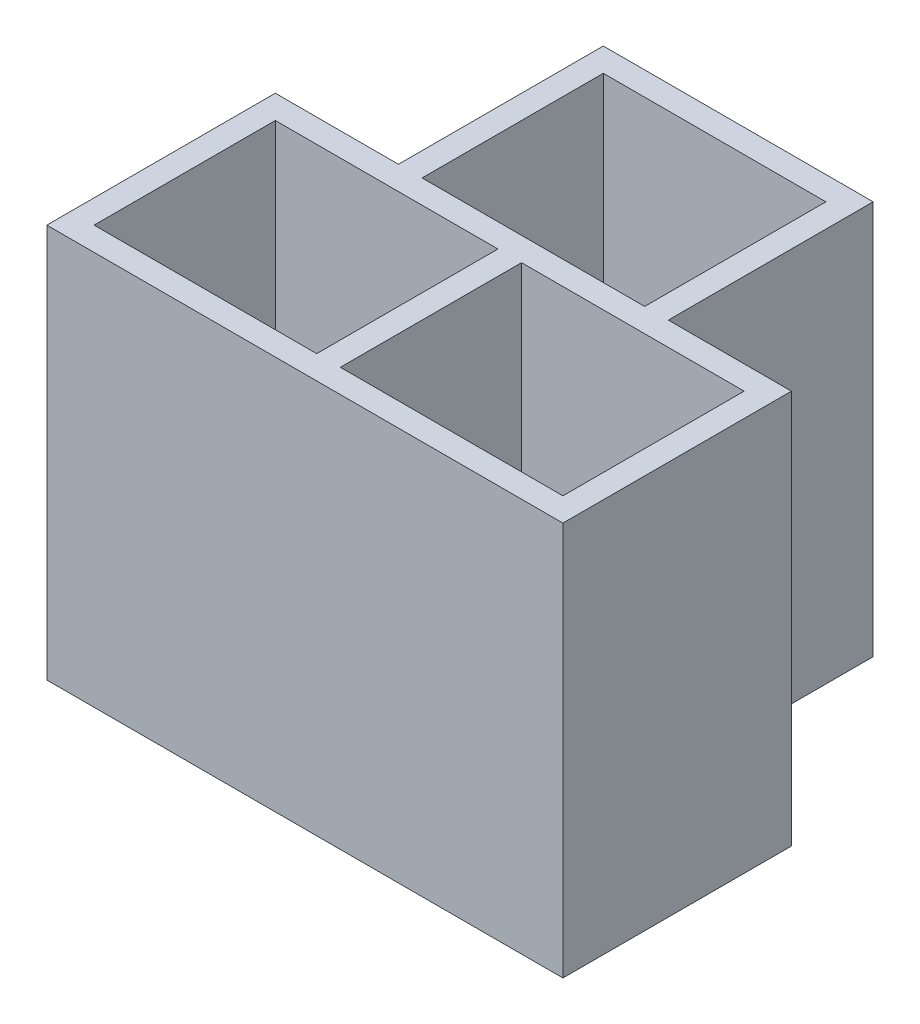
ISO-10303-21;
HEADER;
FILE_DESCRIPTION(('STEP AP214'),'2;1');
FILE_NAME('part.step','',(''),(''),'','','');
FILE_SCHEMA(('AUTOMOTIVE_DESIGN { 1 0 10303 214 1 1 1 1 }'));
ENDSEC;
DATA;
#1=APPLICATION_CONTEXT('core data for automotive mechanical design processes');
#2=APPLICATION_PROTOCOL_DEFINITION('international standard','automotive_design',2000,#1);
#3=PRODUCT_CONTEXT('',#1,'mechanical');
#4=PRODUCT('Part','Part','',(#3));
#5=PRODUCT_RELATED_PRODUCT_CATEGORY('part','',(#4));
#6=PRODUCT_DEFINITION_FORMATION('','',#4);
#7=PRODUCT_DEFINITION_CONTEXT('part definition',#1,'design');
#8=PRODUCT_DEFINITION('design','',#6,#7);
#9=PRODUCT_DEFINITION_SHAPE('','',#8);
#10=(LENGTH_UNIT() NAMED_UNIT(*) SI_UNIT(.MILLI.,.METRE.));
#11=(NAMED_UNIT(*) PLANE_ANGLE_UNIT() SI_UNIT($,.RADIAN.));
#12=(NAMED_UNIT(*) SI_UNIT($,.STERADIAN.) SOLID_ANGLE_UNIT());
#13=UNCERTAINTY_MEASURE_WITH_UNIT(LENGTH_MEASURE(1.E-05),#10,'distance_accuracy_value','');
#14=(GEOMETRIC_REPRESENTATION_CONTEXT(3) GLOBAL_UNCERTAINTY_ASSIGNED_CONTEXT((#13)) GLOBAL_UNIT_ASSIGNED_CONTEXT((#10,
#11,#12)) REPRESENTATION_CONTEXT('',''));
#15=CARTESIAN_POINT('',(0.,0.,0.));
#16=DIRECTION('',(0.,0.,1.));
#17=DIRECTION('',(1.,0.,0.));
#18=AXIS2_PLACEMENT_3D('',#15,#16,#17);
#19=CARTESIAN_POINT('',(-6.55,-5.,-2.9));
#20=DIRECTION('',(0.,0.,-1.));
#21=DIRECTION('',(-1.,0.,0.));
#22=AXIS2_PLACEMENT_3D('',#19,#20,#21);
#23=PLANE('',#22);
#24=DIRECTION('',(-1.,0.,0.));
#25=VECTOR('',#24,1.);
#26=CARTESIAN_POINT('',(-2.825,-1.6,-2.9));
#27=LINE('',#26,#25);
#28=CARTESIAN_POINT('',(2.825,-1.6,-2.9));
#29=VERTEX_POINT('',#28);
#30=CARTESIAN_POINT('',(-2.825,-1.6,-2.9));
#31=VERTEX_POINT('',#30);
#32=EDGE_CURVE('E184',#29,#31,#27,.T.);
#33=ORIENTED_EDGE('',*,*,#32,.T.);
#34=DIRECTION('',(0.,-1.,0.));
#35=VECTOR('',#34,1.);
#36=CARTESIAN_POINT('',(-2.825,13.600145347609,-2.9));
#37=LINE('',#36,#35);
#38=CARTESIAN_POINT('',(-2.825,5.,-2.9));
#39=VERTEX_POINT('',#38);
#40=EDGE_CURVE('E209',#39,#31,#37,.T.);
#41=ORIENTED_EDGE('',*,*,#40,.F.);
#42=DIRECTION('',(-1.,0.,0.));
#43=VECTOR('',#42,1.);
#44=CARTESIAN_POINT('',(-6.55,5.,-2.9));
#45=LINE('',#44,#43);
#46=CARTESIAN_POINT('',(2.825,5.,-2.9));
#47=VERTEX_POINT('',#46);
#48=EDGE_CURVE('E334',#47,#39,#45,.T.);
#49=ORIENTED_EDGE('',*,*,#48,.F.);
#50=DIRECTION('',(0.,-1.,0.));
#51=VECTOR('',#50,1.);
#52=CARTESIAN_POINT('',(2.825,13.600145347609,-2.9));
#53=LINE('',#52,#51);
#54=EDGE_CURVE('E215',#47,#29,#53,.T.);
#55=ORIENTED_EDGE('',*,*,#54,.T.);
#56=EDGE_LOOP('',(#33,#41,#49,#55));
#57=FACE_BOUND('',#56,.T.);
#58=ADVANCED_FACE('F41',(#57),#23,.T.);
#59=DIRECTION('',(-1.,0.,0.));
#60=VECTOR('',#59,1.);
#61=CARTESIAN_POINT('',(-6.55,-5.,-2.9));
#62=LINE('',#61,#60);
#63=CARTESIAN_POINT('',(6.55,-5.,-2.9));
#64=VERTEX_POINT('',#63);
#65=CARTESIAN_POINT('',(3.425,-5.,-2.9));
#66=VERTEX_POINT('',#65);
#67=EDGE_CURVE('E347',#64,#66,#62,.T.);
#68=ORIENTED_EDGE('',*,*,#67,.T.);
#69=DIRECTION('',(0.,-1.,0.));
#70=VECTOR('',#69,1.);
#71=CARTESIAN_POINT('',(3.425,13.600145347609,-2.9));
#72=LINE('',#71,#70);
#73=CARTESIAN_POINT('',(3.425,5.,-2.9));
#74=VERTEX_POINT('',#73);
#75=EDGE_CURVE('E219',#74,#66,#72,.T.);
#76=ORIENTED_EDGE('',*,*,#75,.F.);
#77=CARTESIAN_POINT('',(6.55,5.,-2.9));
#78=VERTEX_POINT('',#77);
#79=EDGE_CURVE('E329',#78,#74,#45,.T.);
#80=ORIENTED_EDGE('',*,*,#79,.F.);
#81=DIRECTION('',(0.,1.,0.));
#82=VECTOR('',#81,1.);
#83=CARTESIAN_POINT('',(6.55,-5.,-2.9));
#84=LINE('',#83,#82);
#85=EDGE_CURVE('E51',#64,#78,#84,.T.);
#86=ORIENTED_EDGE('',*,*,#85,.F.);
#87=EDGE_LOOP('',(#68,#76,#80,#86));
#88=FACE_BOUND('',#87,.T.);
#89=ADVANCED_FACE('F415',(#88),#23,.T.);
#90=CARTESIAN_POINT('',(-6.55,-5.,-2.9));
#91=DIRECTION('',(-1.,0.,0.));
#92=DIRECTION('',(0.,0.,1.));
#93=AXIS2_PLACEMENT_3D('',#90,#91,#92);
#94=PLANE('',#93);
#95=DIRECTION('',(0.,1.,0.));
#96=VECTOR('',#95,1.);
#97=CARTESIAN_POINT('',(-6.55,-5.,2.9));
#98=LINE('',#97,#96);
#99=CARTESIAN_POINT('',(-6.55,-5.,2.9));
#100=VERTEX_POINT('',#99);
#101=CARTESIAN_POINT('',(-6.55,5.,2.9));
#102=VERTEX_POINT('',#101);
#103=EDGE_CURVE('E350',#100,#102,#98,.T.);
#104=ORIENTED_EDGE('',*,*,#103,.T.);
#105=DIRECTION('',(0.,0.,1.));
#106=VECTOR('',#105,1.);
#107=CARTESIAN_POINT('',(-6.55,5.,-2.9));
#108=LINE('',#107,#106);
#109=CARTESIAN_POINT('',(-6.55,5.,-2.9));
#110=VERTEX_POINT('',#109);
#111=EDGE_CURVE('E277',#110,#102,#108,.T.);
#112=ORIENTED_EDGE('',*,*,#111,.F.);
#113=DIRECTION('',(0.,1.,0.));
#114=VECTOR('',#113,1.);
#115=CARTESIAN_POINT('',(-6.55,-5.,-2.9));
#116=LINE('',#115,#114);
#117=CARTESIAN_POINT('',(-6.55,-5.,-2.9));
#118=VERTEX_POINT('',#117);
#119=EDGE_CURVE('E12',#118,#110,#116,.T.);
#120=ORIENTED_EDGE('',*,*,#119,.F.);
#121=DIRECTION('',(0.,0.,1.));
#122=VECTOR('',#121,1.);
#123=CARTESIAN_POINT('',(-6.55,-5.,-2.9));
#124=LINE('',#123,#122);
#125=EDGE_CURVE('E333',#118,#100,#124,.T.);
#126=ORIENTED_EDGE('',*,*,#125,.T.);
#127=EDGE_LOOP('',(#104,#112,#120,#126));
#128=FACE_BOUND('',#127,.T.);
#129=ADVANCED_FACE('F43',(#128),#94,.T.);
#130=DIRECTION('',(0.,-1.,0.));
#131=VECTOR('',#130,1.);
#132=CARTESIAN_POINT('',(-3.425,13.600145347609,-2.9));
#133=LINE('',#132,#131);
#134=CARTESIAN_POINT('',(-3.425,5.,-2.9));
#135=VERTEX_POINT('',#134);
#136=CARTESIAN_POINT('',(-3.425,-5.,-2.9));
#137=VERTEX_POINT('',#136);
#138=EDGE_CURVE('E67',#135,#137,#133,.T.);
#139=ORIENTED_EDGE('',*,*,#138,.T.);
#140=EDGE_CURVE('E346',#137,#118,#62,.T.);
#141=ORIENTED_EDGE('',*,*,#140,.T.);
#142=ORIENTED_EDGE('',*,*,#119,.T.);
#143=EDGE_CURVE('E328',#135,#110,#45,.T.);
#144=ORIENTED_EDGE('',*,*,#143,.F.);
#145=EDGE_LOOP('',(#139,#141,#142,#144));
#146=FACE_BOUND('',#145,.T.);
#147=ADVANCED_FACE('F418',(#146),#23,.T.);
#148=CARTESIAN_POINT('',(6.55,-5.,-2.9));
#149=DIRECTION('',(1.,0.,0.));
#150=DIRECTION('',(0.,0.,-1.));
#151=AXIS2_PLACEMENT_3D('',#148,#149,#150);
#152=PLANE('',#151);
#153=ORIENTED_EDGE('',*,*,#85,.T.);
#154=DIRECTION('',(0.,0.,-1.));
#155=VECTOR('',#154,1.);
#156=CARTESIAN_POINT('',(6.55,5.,-2.9));
#157=LINE('',#156,#155);
#158=CARTESIAN_POINT('',(6.55,5.,2.9));
#159=VERTEX_POINT('',#158);
#160=EDGE_CURVE('E324',#159,#78,#157,.T.);
#161=ORIENTED_EDGE('',*,*,#160,.F.);
#162=DIRECTION('',(0.,1.,0.));
#163=VECTOR('',#162,1.);
#164=CARTESIAN_POINT('',(6.55,-5.,2.9));
#165=LINE('',#164,#163);
#166=CARTESIAN_POINT('',(6.55,-5.,2.9));
#167=VERTEX_POINT('',#166);
#168=EDGE_CURVE('E354',#167,#159,#165,.T.);
#169=ORIENTED_EDGE('',*,*,#168,.F.);
#170=DIRECTION('',(0.,0.,-1.));
#171=VECTOR('',#170,1.);
#172=CARTESIAN_POINT('',(6.55,-5.,-2.9));
#173=LINE('',#172,#171);
#174=EDGE_CURVE('E342',#167,#64,#173,.T.);
#175=ORIENTED_EDGE('',*,*,#174,.T.);
#176=EDGE_LOOP('',(#153,#161,#169,#175));
#177=FACE_BOUND('',#176,.T.);
#178=ADVANCED_FACE('F428',(#177),#152,.T.);
#179=CARTESIAN_POINT('',(-6.55,-5.,2.9));
#180=DIRECTION('',(0.,0.,1.));
#181=DIRECTION('',(1.,0.,0.));
#182=AXIS2_PLACEMENT_3D('',#179,#180,#181);
#183=PLANE('',#182);
#184=ORIENTED_EDGE('',*,*,#168,.T.);
#185=DIRECTION('',(1.,0.,0.));
#186=VECTOR('',#185,1.);
#187=CARTESIAN_POINT('',(-6.55,5.,2.9));
#188=LINE('',#187,#186);
#189=EDGE_CURVE('E320',#102,#159,#188,.T.);
#190=ORIENTED_EDGE('',*,*,#189,.F.);
#191=ORIENTED_EDGE('',*,*,#103,.F.);
#192=DIRECTION('',(1.,0.,0.));
#193=VECTOR('',#192,1.);
#194=CARTESIAN_POINT('',(-6.55,-5.,2.9));
#195=LINE('',#194,#193);
#196=EDGE_CURVE('E338',#100,#167,#195,.T.);
#197=ORIENTED_EDGE('',*,*,#196,.T.);
#198=EDGE_LOOP('',(#184,#190,#191,#197));
#199=FACE_BOUND('',#198,.T.);
#200=ADVANCED_FACE('F434',(#199),#183,.T.);
#201=CARTESIAN_POINT('',(0.,-5.,0.));
#202=DIRECTION('',(0.,1.,0.));
#203=DIRECTION('',(0.,0.,1.));
#204=AXIS2_PLACEMENT_3D('',#201,#202,#203);
#205=PLANE('',#204);
#206=ORIENTED_EDGE('',*,*,#140,.F.);
#207=DIRECTION('',(0.,0.,1.));
#208=VECTOR('',#207,1.);
#209=CARTESIAN_POINT('',(-3.425,-5.,0.));
#210=LINE('',#209,#208);
#211=CARTESIAN_POINT('',(-3.425,-5.,-8.1));
#212=VERTEX_POINT('',#211);
#213=EDGE_CURVE('E450',#212,#137,#210,.T.);
#214=ORIENTED_EDGE('',*,*,#213,.F.);
#215=DIRECTION('',(-1.,0.,0.));
#216=VECTOR('',#215,1.);
#217=CARTESIAN_POINT('',(0.,-5.,-8.1));
#218=LINE('',#217,#216);
#219=CARTESIAN_POINT('',(3.425,-5.,-8.1));
#220=VERTEX_POINT('',#219);
#221=EDGE_CURVE('E732',#220,#212,#218,.T.);
#222=ORIENTED_EDGE('',*,*,#221,.F.);
#223=DIRECTION('',(0.,0.,1.));
#224=VECTOR('',#223,1.);
#225=CARTESIAN_POINT('',(3.425,-5.,0.));
#226=LINE('',#225,#224);
#227=EDGE_CURVE('E473',#220,#66,#226,.T.);
#228=ORIENTED_EDGE('',*,*,#227,.T.);
#229=ORIENTED_EDGE('',*,*,#67,.F.);
#230=ORIENTED_EDGE('',*,*,#174,.F.);
#231=ORIENTED_EDGE('',*,*,#196,.F.);
#232=ORIENTED_EDGE('',*,*,#125,.F.);
#233=EDGE_LOOP('',(#206,#214,#222,#228,#229,#230,#231,#232));
#234=FACE_BOUND('',#233,.T.);
#235=CARTESIAN_POINT('',(-4.625,-5.,0.));
#236=DIRECTION('',(0.,1.,0.));
#237=DIRECTION('',(0.,0.,1.));
#238=AXIS2_PLACEMENT_3D('',#235,#236,#237);
#239=CIRCLE('',#238,0.750000000000001);
#240=CARTESIAN_POINT('',(-4.625,-5.,0.750000000000001));
#241=VERTEX_POINT('',#240);
#242=EDGE_CURVE('E220',#241,#241,#239,.T.);
#243=ORIENTED_EDGE('',*,*,#242,.T.);
#244=EDGE_LOOP('',(#243));
#245=FACE_BOUND('',#244,.T.);
#246=CARTESIAN_POINT('',(-1.625,-5.,0.));
#247=DIRECTION('',(0.,1.,0.));
#248=DIRECTION('',(0.,0.,-1.));
#249=AXIS2_PLACEMENT_3D('',#246,#247,#248);
#250=CIRCLE('',#249,0.75);
#251=CARTESIAN_POINT('',(-1.625,-5.,-0.75));
#252=VERTEX_POINT('',#251);
#253=EDGE_CURVE('E225',#252,#252,#250,.T.);
#254=ORIENTED_EDGE('',*,*,#253,.T.);
#255=EDGE_LOOP('',(#254));
#256=FACE_BOUND('',#255,.T.);
#257=CARTESIAN_POINT('',(1.625,-5.,0.));
#258=DIRECTION('',(0.,1.,0.));
#259=DIRECTION('',(0.,0.,1.));
#260=AXIS2_PLACEMENT_3D('',#257,#258,#259);
#261=CIRCLE('',#260,0.75);
#262=CARTESIAN_POINT('',(1.625,-5.,0.750000000000001));
#263=VERTEX_POINT('',#262);
#264=EDGE_CURVE('E229',#263,#263,#261,.T.);
#265=ORIENTED_EDGE('',*,*,#264,.T.);
#266=EDGE_LOOP('',(#265));
#267=FACE_BOUND('',#266,.T.);
#268=CARTESIAN_POINT('',(4.625,-5.,0.));
#269=DIRECTION('',(0.,1.,0.));
#270=DIRECTION('',(0.,0.,-1.));
#271=AXIS2_PLACEMENT_3D('',#268,#269,#270);
#272=CIRCLE('',#271,0.750000000000001);
#273=CARTESIAN_POINT('',(4.625,-5.,-0.750000000000001));
#274=VERTEX_POINT('',#273);
#275=EDGE_CURVE('E218',#274,#274,#272,.T.);
#276=ORIENTED_EDGE('',*,*,#275,.T.);
#277=EDGE_LOOP('',(#276));
#278=FACE_BOUND('',#277,.T.);
#279=CARTESIAN_POINT('',(1.5,-5.,-5.2));
#280=DIRECTION('',(0.,-1.,0.));
#281=DIRECTION('',(0.,0.,1.));
#282=AXIS2_PLACEMENT_3D('',#279,#280,#281);
#283=CIRCLE('',#282,0.75);
#284=CARTESIAN_POINT('',(1.5,-5.,-4.45));
#285=VERTEX_POINT('',#284);
#286=EDGE_CURVE('E722',#285,#285,#283,.T.);
#287=ORIENTED_EDGE('',*,*,#286,.F.);
#288=EDGE_LOOP('',(#287));
#289=FACE_BOUND('',#288,.T.);
#290=CARTESIAN_POINT('',(-1.5,-5.,-5.2));
#291=DIRECTION('',(0.,-1.,0.));
#292=DIRECTION('',(0.,0.,-1.));
#293=AXIS2_PLACEMENT_3D('',#290,#291,#292);
#294=CIRCLE('',#293,0.75);
#295=CARTESIAN_POINT('',(-1.5,-5.,-5.95));
#296=VERTEX_POINT('',#295);
#297=EDGE_CURVE('E200',#296,#296,#294,.T.);
#298=ORIENTED_EDGE('',*,*,#297,.F.);
#299=EDGE_LOOP('',(#298));
#300=FACE_BOUND('',#299,.T.);
#301=ADVANCED_FACE('F447',(#234,#245,#256,#267,#278,#289,#300),#205,.F.);
#302=CARTESIAN_POINT('',(0.,5.,0.));
#303=DIRECTION('',(0.,1.,0.));
#304=DIRECTION('',(0.,0.,1.));
#305=AXIS2_PLACEMENT_3D('',#302,#303,#304);
#306=PLANE('',#305);
#307=ORIENTED_EDGE('',*,*,#48,.T.);
#308=DIRECTION('',(0.,0.,-1.));
#309=VECTOR('',#308,1.);
#310=CARTESIAN_POINT('',(-2.825,5.,0.));
#311=LINE('',#310,#309);
#312=CARTESIAN_POINT('',(-2.825,5.,-7.5));
#313=VERTEX_POINT('',#312);
#314=EDGE_CURVE('E472',#39,#313,#311,.T.);
#315=ORIENTED_EDGE('',*,*,#314,.T.);
#316=DIRECTION('',(1.,0.,0.));
#317=VECTOR('',#316,1.);
#318=CARTESIAN_POINT('',(0.,5.,-7.5));
#319=LINE('',#318,#317);
#320=CARTESIAN_POINT('',(2.825,5.,-7.5));
#321=VERTEX_POINT('',#320);
#322=EDGE_CURVE('E211',#313,#321,#319,.T.);
#323=ORIENTED_EDGE('',*,*,#322,.T.);
#324=DIRECTION('',(0.,0.,-1.));
#325=VECTOR('',#324,1.);
#326=CARTESIAN_POINT('',(2.825,5.,0.));
#327=LINE('',#326,#325);
#328=EDGE_CURVE('E204',#47,#321,#327,.T.);
#329=ORIENTED_EDGE('',*,*,#328,.F.);
#330=EDGE_LOOP('',(#307,#315,#323,#329));
#331=FACE_BOUND('',#330,.T.);
#332=DIRECTION('',(0.,0.,1.));
#333=VECTOR('',#332,1.);
#334=CARTESIAN_POINT('',(-5.95,5.,-2.3));
#335=LINE('',#334,#333);
#336=CARTESIAN_POINT('',(-5.95,5.,-2.3));
#337=VERTEX_POINT('',#336);
#338=CARTESIAN_POINT('',(-5.95,5.,2.3));
#339=VERTEX_POINT('',#338);
#340=EDGE_CURVE('E247',#337,#339,#335,.T.);
#341=ORIENTED_EDGE('',*,*,#340,.F.);
#342=DIRECTION('',(-1.,0.,0.));
#343=VECTOR('',#342,1.);
#344=CARTESIAN_POINT('',(-5.95,5.,-2.3));
#345=LINE('',#344,#343);
#346=CARTESIAN_POINT('',(-0.3,5.,-2.3));
#347=VERTEX_POINT('',#346);
#348=EDGE_CURVE('E259',#347,#337,#345,.T.);
#349=ORIENTED_EDGE('',*,*,#348,.F.);
#350=DIRECTION('',(0.,0.,-1.));
#351=VECTOR('',#350,1.);
#352=CARTESIAN_POINT('',(-0.3,5.,-2.3));
#353=LINE('',#352,#351);
#354=CARTESIAN_POINT('',(-0.3,5.,2.3));
#355=VERTEX_POINT('',#354);
#356=EDGE_CURVE('E255',#355,#347,#353,.T.);
#357=ORIENTED_EDGE('',*,*,#356,.F.);
#358=DIRECTION('',(1.,0.,0.));
#359=VECTOR('',#358,1.);
#360=CARTESIAN_POINT('',(-5.95,5.,2.3));
#361=LINE('',#360,#359);
#362=EDGE_CURVE('E250',#339,#355,#361,.T.);
#363=ORIENTED_EDGE('',*,*,#362,.F.);
#364=EDGE_LOOP('',(#341,#349,#357,#363));
#365=FACE_BOUND('',#364,.T.);
#366=DIRECTION('',(1.,0.,0.));
#367=VECTOR('',#366,1.);
#368=CARTESIAN_POINT('',(0.3,5.,2.3));
#369=LINE('',#368,#367);
#370=CARTESIAN_POINT('',(0.3,5.,2.3));
#371=VERTEX_POINT('',#370);
#372=CARTESIAN_POINT('',(5.95,5.,2.3));
#373=VERTEX_POINT('',#372);
#374=EDGE_CURVE('E288',#371,#373,#369,.T.);
#375=ORIENTED_EDGE('',*,*,#374,.F.);
#376=DIRECTION('',(0.,0.,1.));
#377=VECTOR('',#376,1.);
#378=CARTESIAN_POINT('',(0.3,5.,-2.3));
#379=LINE('',#378,#377);
#380=CARTESIAN_POINT('',(0.3,5.,-2.3));
#381=VERTEX_POINT('',#380);
#382=EDGE_CURVE('E299',#381,#371,#379,.T.);
#383=ORIENTED_EDGE('',*,*,#382,.F.);
#384=DIRECTION('',(-1.,0.,0.));
#385=VECTOR('',#384,1.);
#386=CARTESIAN_POINT('',(0.3,5.,-2.3));
#387=LINE('',#386,#385);
#388=CARTESIAN_POINT('',(5.95,5.,-2.3));
#389=VERTEX_POINT('',#388);
#390=EDGE_CURVE('E295',#389,#381,#387,.T.);
#391=ORIENTED_EDGE('',*,*,#390,.F.);
#392=DIRECTION('',(0.,0.,-1.));
#393=VECTOR('',#392,1.);
#394=CARTESIAN_POINT('',(5.95,5.,-2.3));
#395=LINE('',#394,#393);
#396=EDGE_CURVE('E291',#373,#389,#395,.T.);
#397=ORIENTED_EDGE('',*,*,#396,.F.);
#398=EDGE_LOOP('',(#375,#383,#391,#397));
#399=FACE_BOUND('',#398,.T.);
#400=ORIENTED_EDGE('',*,*,#111,.T.);
#401=ORIENTED_EDGE('',*,*,#189,.T.);
#402=ORIENTED_EDGE('',*,*,#160,.T.);
#403=ORIENTED_EDGE('',*,*,#79,.T.);
#404=DIRECTION('',(0.,0.,-1.));
#405=VECTOR('',#404,1.);
#406=CARTESIAN_POINT('',(3.425,5.,0.));
#407=LINE('',#406,#405);
#408=CARTESIAN_POINT('',(3.425,5.,-8.1));
#409=VERTEX_POINT('',#408);
#410=EDGE_CURVE('E465',#74,#409,#407,.T.);
#411=ORIENTED_EDGE('',*,*,#410,.T.);
#412=DIRECTION('',(1.,0.,0.));
#413=VECTOR('',#412,1.);
#414=CARTESIAN_POINT('',(0.,5.,-8.1));
#415=LINE('',#414,#413);
#416=CARTESIAN_POINT('',(-3.425,5.,-8.1));
#417=VERTEX_POINT('',#416);
#418=EDGE_CURVE('E468',#417,#409,#415,.T.);
#419=ORIENTED_EDGE('',*,*,#418,.F.);
#420=DIRECTION('',(0.,0.,-1.));
#421=VECTOR('',#420,1.);
#422=CARTESIAN_POINT('',(-3.425,5.,0.));
#423=LINE('',#422,#421);
#424=EDGE_CURVE('E442',#135,#417,#423,.T.);
#425=ORIENTED_EDGE('',*,*,#424,.F.);
#426=ORIENTED_EDGE('',*,*,#143,.T.);
#427=EDGE_LOOP('',(#400,#401,#402,#403,#411,#419,#425,#426));
#428=FACE_BOUND('',#427,.T.);
#429=ADVANCED_FACE('F398',(#331,#365,#399,#428),#306,.T.);
#430=CARTESIAN_POINT('',(0.3,-12.2857738092807,2.3));
#431=DIRECTION('',(0.,0.,1.));
#432=DIRECTION('',(1.,0.,0.));
#433=AXIS2_PLACEMENT_3D('',#430,#431,#432);
#434=PLANE('',#433);
#435=DIRECTION('',(-1.,0.,0.));
#436=VECTOR('',#435,1.);
#437=CARTESIAN_POINT('',(0.3,-1.6,2.3));
#438=LINE('',#437,#436);
#439=CARTESIAN_POINT('',(5.95,-1.6,2.3));
#440=VERTEX_POINT('',#439);
#441=CARTESIAN_POINT('',(0.3,-1.6,2.3));
#442=VERTEX_POINT('',#441);
#443=EDGE_CURVE('E285',#440,#442,#438,.T.);
#444=ORIENTED_EDGE('',*,*,#443,.T.);
#445=DIRECTION('',(0.,1.,0.));
#446=VECTOR('',#445,1.);
#447=CARTESIAN_POINT('',(0.3,-12.2857738092807,2.3));
#448=LINE('',#447,#446);
#449=EDGE_CURVE('E282',#442,#371,#448,.T.);
#450=ORIENTED_EDGE('',*,*,#449,.T.);
#451=ORIENTED_EDGE('',*,*,#374,.T.);
#452=DIRECTION('',(0.,1.,0.));
#453=VECTOR('',#452,1.);
#454=CARTESIAN_POINT('',(5.95,-12.2857738092807,2.3));
#455=LINE('',#454,#453);
#456=EDGE_CURVE('E303',#440,#373,#455,.T.);
#457=ORIENTED_EDGE('',*,*,#456,.F.);
#458=EDGE_LOOP('',(#444,#450,#451,#457));
#459=FACE_BOUND('',#458,.T.);
#460=ADVANCED_FACE('F391',(#459),#434,.F.);
#461=CARTESIAN_POINT('',(0.3,-12.2857738092807,-2.3));
#462=DIRECTION('',(-1.,0.,0.));
#463=DIRECTION('',(0.,0.,1.));
#464=AXIS2_PLACEMENT_3D('',#461,#462,#463);
#465=PLANE('',#464);
#466=DIRECTION('',(0.,0.,-1.));
#467=VECTOR('',#466,1.);
#468=CARTESIAN_POINT('',(0.3,-1.6,-2.3));
#469=LINE('',#468,#467);
#470=CARTESIAN_POINT('',(0.3,-1.6,-2.3));
#471=VERTEX_POINT('',#470);
#472=EDGE_CURVE('E281',#442,#471,#469,.T.);
#473=ORIENTED_EDGE('',*,*,#472,.T.);
#474=DIRECTION('',(0.,1.,0.));
#475=VECTOR('',#474,1.);
#476=CARTESIAN_POINT('',(0.3,-12.2857738092807,-2.3));
#477=LINE('',#476,#475);
#478=EDGE_CURVE('E306',#471,#381,#477,.T.);
#479=ORIENTED_EDGE('',*,*,#478,.T.);
#480=ORIENTED_EDGE('',*,*,#382,.T.);
#481=ORIENTED_EDGE('',*,*,#449,.F.);
#482=EDGE_LOOP('',(#473,#479,#480,#481));
#483=FACE_BOUND('',#482,.T.);
#484=ADVANCED_FACE('F405',(#483),#465,.F.);
#485=CARTESIAN_POINT('',(0.3,-12.2857738092807,-2.3));
#486=DIRECTION('',(0.,0.,-1.));
#487=DIRECTION('',(-1.,0.,0.));
#488=AXIS2_PLACEMENT_3D('',#485,#486,#487);
#489=PLANE('',#488);
#490=DIRECTION('',(1.,0.,0.));
#491=VECTOR('',#490,1.);
#492=CARTESIAN_POINT('',(0.3,-1.6,-2.3));
#493=LINE('',#492,#491);
#494=CARTESIAN_POINT('',(5.95,-1.6,-2.3));
#495=VERTEX_POINT('',#494);
#496=EDGE_CURVE('E278',#471,#495,#493,.T.);
#497=ORIENTED_EDGE('',*,*,#496,.T.);
#498=DIRECTION('',(0.,1.,0.));
#499=VECTOR('',#498,1.);
#500=CARTESIAN_POINT('',(5.95,-12.2857738092807,-2.3));
#501=LINE('',#500,#499);
#502=EDGE_CURVE('E309',#495,#389,#501,.T.);
#503=ORIENTED_EDGE('',*,*,#502,.T.);
#504=ORIENTED_EDGE('',*,*,#390,.T.);
#505=ORIENTED_EDGE('',*,*,#478,.F.);
#506=EDGE_LOOP('',(#497,#503,#504,#505));
#507=FACE_BOUND('',#506,.T.);
#508=ADVANCED_FACE('F403',(#507),#489,.F.);
#509=CARTESIAN_POINT('',(5.95,-12.2857738092807,-2.3));
#510=DIRECTION('',(1.,0.,0.));
#511=DIRECTION('',(0.,0.,-1.));
#512=AXIS2_PLACEMENT_3D('',#509,#510,#511);
#513=PLANE('',#512);
#514=DIRECTION('',(0.,0.,1.));
#515=VECTOR('',#514,1.);
#516=CARTESIAN_POINT('',(5.95,-1.6,-2.3));
#517=LINE('',#516,#515);
#518=EDGE_CURVE('E251',#495,#440,#517,.T.);
#519=ORIENTED_EDGE('',*,*,#518,.T.);
#520=ORIENTED_EDGE('',*,*,#456,.T.);
#521=ORIENTED_EDGE('',*,*,#396,.T.);
#522=ORIENTED_EDGE('',*,*,#502,.F.);
#523=EDGE_LOOP('',(#519,#520,#521,#522));
#524=FACE_BOUND('',#523,.T.);
#525=ADVANCED_FACE('F381',(#524),#513,.F.);
#526=CARTESIAN_POINT('',(0.,-1.6,0.));
#527=DIRECTION('',(0.,1.,0.));
#528=DIRECTION('',(0.,0.,1.));
#529=AXIS2_PLACEMENT_3D('',#526,#527,#528);
#530=PLANE('',#529);
#531=CARTESIAN_POINT('',(1.625,-1.6,0.));
#532=DIRECTION('',(0.,1.,0.));
#533=DIRECTION('',(0.,0.,1.));
#534=AXIS2_PLACEMENT_3D('',#531,#532,#533);
#535=CIRCLE('',#534,0.75);
#536=CARTESIAN_POINT('',(1.625,-1.6,0.750000000000001));
#537=VERTEX_POINT('',#536);
#538=EDGE_CURVE('E45',#537,#537,#535,.T.);
#539=ORIENTED_EDGE('',*,*,#538,.F.);
#540=EDGE_LOOP('',(#539));
#541=FACE_BOUND('',#540,.T.);
#542=CARTESIAN_POINT('',(4.625,-1.6,0.));
#543=DIRECTION('',(0.,1.,0.));
#544=DIRECTION('',(0.,0.,1.));
#545=AXIS2_PLACEMENT_3D('',#542,#543,#544);
#546=CIRCLE('',#545,0.750000000000001);
#547=CARTESIAN_POINT('',(4.625,-1.6,0.750000000000001));
#548=VERTEX_POINT('',#547);
#549=EDGE_CURVE('E365',#548,#548,#546,.T.);
#550=ORIENTED_EDGE('',*,*,#549,.F.);
#551=EDGE_LOOP('',(#550));
#552=FACE_BOUND('',#551,.T.);
#553=ORIENTED_EDGE('',*,*,#443,.F.);
#554=ORIENTED_EDGE('',*,*,#518,.F.);
#555=ORIENTED_EDGE('',*,*,#496,.F.);
#556=ORIENTED_EDGE('',*,*,#472,.F.);
#557=EDGE_LOOP('',(#553,#554,#555,#556));
#558=FACE_BOUND('',#557,.T.);
#559=ADVANCED_FACE('F377',(#541,#552,#558),#530,.T.);
#560=CARTESIAN_POINT('',(-5.95,-12.2857738092807,-2.3));
#561=DIRECTION('',(-1.,0.,0.));
#562=DIRECTION('',(0.,0.,1.));
#563=AXIS2_PLACEMENT_3D('',#560,#561,#562);
#564=PLANE('',#563);
#565=DIRECTION('',(0.,0.,-1.));
#566=VECTOR('',#565,1.);
#567=CARTESIAN_POINT('',(-5.95,-1.6,-2.3));
#568=LINE('',#567,#566);
#569=CARTESIAN_POINT('',(-5.95,-1.6,2.3));
#570=VERTEX_POINT('',#569);
#571=CARTESIAN_POINT('',(-5.95,-1.6,-2.3));
#572=VERTEX_POINT('',#571);
#573=EDGE_CURVE('E243',#570,#572,#568,.T.);
#574=ORIENTED_EDGE('',*,*,#573,.T.);
#575=DIRECTION('',(0.,1.,0.));
#576=VECTOR('',#575,1.);
#577=CARTESIAN_POINT('',(-5.95,-12.2857738092807,-2.3));
#578=LINE('',#577,#576);
#579=EDGE_CURVE('E240',#572,#337,#578,.T.);
#580=ORIENTED_EDGE('',*,*,#579,.T.);
#581=ORIENTED_EDGE('',*,*,#340,.T.);
#582=DIRECTION('',(0.,1.,0.));
#583=VECTOR('',#582,1.);
#584=CARTESIAN_POINT('',(-5.95,-12.2857738092807,2.3));
#585=LINE('',#584,#583);
#586=EDGE_CURVE('E263',#570,#339,#585,.T.);
#587=ORIENTED_EDGE('',*,*,#586,.F.);
#588=EDGE_LOOP('',(#574,#580,#581,#587));
#589=FACE_BOUND('',#588,.T.);
#590=ADVANCED_FACE('F380',(#589),#564,.F.);
#591=CARTESIAN_POINT('',(-5.95,-12.2857738092807,-2.3));
#592=DIRECTION('',(0.,0.,-1.));
#593=DIRECTION('',(-1.,0.,0.));
#594=AXIS2_PLACEMENT_3D('',#591,#592,#593);
#595=PLANE('',#594);
#596=DIRECTION('',(1.,0.,0.));
#597=VECTOR('',#596,1.);
#598=CARTESIAN_POINT('',(-5.95,-1.6,-2.3));
#599=LINE('',#598,#597);
#600=CARTESIAN_POINT('',(-0.3,-1.6,-2.3));
#601=VERTEX_POINT('',#600);
#602=EDGE_CURVE('E239',#572,#601,#599,.T.);
#603=ORIENTED_EDGE('',*,*,#602,.T.);
#604=DIRECTION('',(0.,1.,0.));
#605=VECTOR('',#604,1.);
#606=CARTESIAN_POINT('',(-0.3,-12.2857738092807,-2.3));
#607=LINE('',#606,#605);
#608=EDGE_CURVE('E266',#601,#347,#607,.T.);
#609=ORIENTED_EDGE('',*,*,#608,.T.);
#610=ORIENTED_EDGE('',*,*,#348,.T.);
#611=ORIENTED_EDGE('',*,*,#579,.F.);
#612=EDGE_LOOP('',(#603,#609,#610,#611));
#613=FACE_BOUND('',#612,.T.);
#614=ADVANCED_FACE('F525',(#613),#595,.F.);
#615=CARTESIAN_POINT('',(-0.3,-12.2857738092807,-2.3));
#616=DIRECTION('',(1.,0.,0.));
#617=DIRECTION('',(0.,0.,-1.));
#618=AXIS2_PLACEMENT_3D('',#615,#616,#617);
#619=PLANE('',#618);
#620=DIRECTION('',(0.,0.,1.));
#621=VECTOR('',#620,1.);
#622=CARTESIAN_POINT('',(-0.3,-1.6,-2.3));
#623=LINE('',#622,#621);
#624=CARTESIAN_POINT('',(-0.3,-1.6,2.3));
#625=VERTEX_POINT('',#624);
#626=EDGE_CURVE('E236',#601,#625,#623,.T.);
#627=ORIENTED_EDGE('',*,*,#626,.T.);
#628=DIRECTION('',(0.,1.,0.));
#629=VECTOR('',#628,1.);
#630=CARTESIAN_POINT('',(-0.3,-12.2857738092807,2.3));
#631=LINE('',#630,#629);
#632=EDGE_CURVE('E269',#625,#355,#631,.T.);
#633=ORIENTED_EDGE('',*,*,#632,.T.);
#634=ORIENTED_EDGE('',*,*,#356,.T.);
#635=ORIENTED_EDGE('',*,*,#608,.F.);
#636=EDGE_LOOP('',(#627,#633,#634,#635));
#637=FACE_BOUND('',#636,.T.);
#638=ADVANCED_FACE('F527',(#637),#619,.F.);
#639=CARTESIAN_POINT('',(-5.95,-12.2857738092807,2.3));
#640=DIRECTION('',(0.,0.,1.));
#641=DIRECTION('',(1.,0.,0.));
#642=AXIS2_PLACEMENT_3D('',#639,#640,#641);
#643=PLANE('',#642);
#644=DIRECTION('',(-1.,0.,0.));
#645=VECTOR('',#644,1.);
#646=CARTESIAN_POINT('',(-5.95,-1.6,2.3));
#647=LINE('',#646,#645);
#648=EDGE_CURVE('E246',#625,#570,#647,.T.);
#649=ORIENTED_EDGE('',*,*,#648,.T.);
#650=ORIENTED_EDGE('',*,*,#586,.T.);
#651=ORIENTED_EDGE('',*,*,#362,.T.);
#652=ORIENTED_EDGE('',*,*,#632,.F.);
#653=EDGE_LOOP('',(#649,#650,#651,#652));
#654=FACE_BOUND('',#653,.T.);
#655=ADVANCED_FACE('F515',(#654),#643,.F.);
#656=CARTESIAN_POINT('',(0.,-1.6,0.));
#657=DIRECTION('',(0.,1.,0.));
#658=DIRECTION('',(0.,0.,1.));
#659=AXIS2_PLACEMENT_3D('',#656,#657,#658);
#660=PLANE('',#659);
#661=CARTESIAN_POINT('',(-4.625,-1.6,0.));
#662=DIRECTION('',(0.,1.,0.));
#663=DIRECTION('',(0.,0.,1.));
#664=AXIS2_PLACEMENT_3D('',#661,#662,#663);
#665=CIRCLE('',#664,0.750000000000001);
#666=CARTESIAN_POINT('',(-4.625,-1.6,0.750000000000001));
#667=VERTEX_POINT('',#666);
#668=EDGE_CURVE('E362',#667,#667,#665,.T.);
#669=ORIENTED_EDGE('',*,*,#668,.F.);
#670=EDGE_LOOP('',(#669));
#671=FACE_BOUND('',#670,.T.);
#672=CARTESIAN_POINT('',(-1.625,-1.6,0.));
#673=DIRECTION('',(0.,1.,0.));
#674=DIRECTION('',(0.,0.,1.));
#675=AXIS2_PLACEMENT_3D('',#672,#673,#674);
#676=CIRCLE('',#675,0.75);
#677=CARTESIAN_POINT('',(-1.625,-1.6,0.750000000000001));
#678=VERTEX_POINT('',#677);
#679=EDGE_CURVE('E224',#678,#678,#676,.T.);
#680=ORIENTED_EDGE('',*,*,#679,.F.);
#681=EDGE_LOOP('',(#680));
#682=FACE_BOUND('',#681,.T.);
#683=ORIENTED_EDGE('',*,*,#573,.F.);
#684=ORIENTED_EDGE('',*,*,#648,.F.);
#685=ORIENTED_EDGE('',*,*,#626,.F.);
#686=ORIENTED_EDGE('',*,*,#602,.F.);
#687=EDGE_LOOP('',(#683,#684,#685,#686));
#688=FACE_BOUND('',#687,.T.);
#689=ADVANCED_FACE('F522',(#671,#682,#688),#660,.T.);
#690=CARTESIAN_POINT('',(-1.625,-5.,0.));
#691=DIRECTION('',(0.,1.,0.));
#692=DIRECTION('',(0.,0.,1.));
#693=AXIS2_PLACEMENT_3D('',#690,#691,#692);
#694=CYLINDRICAL_SURFACE('',#693,0.75);
#695=ORIENTED_EDGE('',*,*,#679,.T.);
#696=EDGE_LOOP('',(#695));
#697=FACE_BOUND('',#696,.T.);
#698=ORIENTED_EDGE('',*,*,#253,.F.);
#699=EDGE_LOOP('',(#698));
#700=FACE_BOUND('',#699,.T.);
#701=ADVANCED_FACE('F573',(#697,#700),#694,.F.);
#702=CARTESIAN_POINT('',(-4.625,-5.,0.));
#703=DIRECTION('',(0.,1.,0.));
#704=DIRECTION('',(0.,0.,1.));
#705=AXIS2_PLACEMENT_3D('',#702,#703,#704);
#706=CYLINDRICAL_SURFACE('',#705,0.750000000000001);
#707=ORIENTED_EDGE('',*,*,#668,.T.);
#708=EDGE_LOOP('',(#707));
#709=FACE_BOUND('',#708,.T.);
#710=ORIENTED_EDGE('',*,*,#242,.F.);
#711=EDGE_LOOP('',(#710));
#712=FACE_BOUND('',#711,.T.);
#713=ADVANCED_FACE('F582',(#709,#712),#706,.F.);
#714=CARTESIAN_POINT('',(4.625,-5.,0.));
#715=DIRECTION('',(0.,1.,0.));
#716=DIRECTION('',(0.,0.,1.));
#717=AXIS2_PLACEMENT_3D('',#714,#715,#716);
#718=CYLINDRICAL_SURFACE('',#717,0.750000000000001);
#719=ORIENTED_EDGE('',*,*,#549,.T.);
#720=EDGE_LOOP('',(#719));
#721=FACE_BOUND('',#720,.T.);
#722=ORIENTED_EDGE('',*,*,#275,.F.);
#723=EDGE_LOOP('',(#722));
#724=FACE_BOUND('',#723,.T.);
#725=ADVANCED_FACE('F592',(#721,#724),#718,.F.);
#726=CARTESIAN_POINT('',(1.625,-5.,0.));
#727=DIRECTION('',(0.,1.,0.));
#728=DIRECTION('',(0.,0.,1.));
#729=AXIS2_PLACEMENT_3D('',#726,#727,#728);
#730=CYLINDRICAL_SURFACE('',#729,0.75);
#731=ORIENTED_EDGE('',*,*,#538,.T.);
#732=EDGE_LOOP('',(#731));
#733=FACE_BOUND('',#732,.T.);
#734=ORIENTED_EDGE('',*,*,#264,.F.);
#735=EDGE_LOOP('',(#734));
#736=FACE_BOUND('',#735,.T.);
#737=ADVANCED_FACE('F374',(#733,#736),#730,.F.);
#738=CARTESIAN_POINT('',(2.825,13.600145347609,0.));
#739=DIRECTION('',(-1.,0.,0.));
#740=DIRECTION('',(0.,0.,1.));
#741=AXIS2_PLACEMENT_3D('',#738,#739,#740);
#742=PLANE('',#741);
#743=DIRECTION('',(0.,0.,1.));
#744=VECTOR('',#743,1.);
#745=CARTESIAN_POINT('',(2.825,-1.6,-2.9));
#746=LINE('',#745,#744);
#747=CARTESIAN_POINT('',(2.825,-1.6,-7.5));
#748=VERTEX_POINT('',#747);
#749=EDGE_CURVE('E180',#748,#29,#746,.T.);
#750=ORIENTED_EDGE('',*,*,#749,.T.);
#751=ORIENTED_EDGE('',*,*,#54,.F.);
#752=ORIENTED_EDGE('',*,*,#328,.T.);
#753=DIRECTION('',(0.,-1.,0.));
#754=VECTOR('',#753,1.);
#755=CARTESIAN_POINT('',(2.825,13.600145347609,-7.5));
#756=LINE('',#755,#754);
#757=EDGE_CURVE('E195',#321,#748,#756,.T.);
#758=ORIENTED_EDGE('',*,*,#757,.T.);
#759=EDGE_LOOP('',(#750,#751,#752,#758));
#760=FACE_BOUND('',#759,.T.);
#761=ADVANCED_FACE('F202',(#760),#742,.T.);
#762=CARTESIAN_POINT('',(0.,13.600145347609,-7.5));
#763=DIRECTION('',(0.,0.,-1.));
#764=DIRECTION('',(-1.,0.,0.));
#765=AXIS2_PLACEMENT_3D('',#762,#763,#764);
#766=PLANE('',#765);
#767=DIRECTION('',(0.,-1.,0.));
#768=VECTOR('',#767,1.);
#769=CARTESIAN_POINT('',(-2.825,13.600145347609,-7.5));
#770=LINE('',#769,#768);
#771=CARTESIAN_POINT('',(-2.825,-1.6,-7.5));
#772=VERTEX_POINT('',#771);
#773=EDGE_CURVE('E198',#313,#772,#770,.T.);
#774=ORIENTED_EDGE('',*,*,#773,.T.);
#775=DIRECTION('',(1.,0.,0.));
#776=VECTOR('',#775,1.);
#777=CARTESIAN_POINT('',(-2.825,-1.6,-7.5));
#778=LINE('',#777,#776);
#779=EDGE_CURVE('E59',#772,#748,#778,.T.);
#780=ORIENTED_EDGE('',*,*,#779,.T.);
#781=ORIENTED_EDGE('',*,*,#757,.F.);
#782=ORIENTED_EDGE('',*,*,#322,.F.);
#783=EDGE_LOOP('',(#774,#780,#781,#782));
#784=FACE_BOUND('',#783,.T.);
#785=ADVANCED_FACE('F193',(#784),#766,.F.);
#786=CARTESIAN_POINT('',(-2.825,13.600145347609,0.));
#787=DIRECTION('',(-1.,0.,0.));
#788=DIRECTION('',(0.,0.,1.));
#789=AXIS2_PLACEMENT_3D('',#786,#787,#788);
#790=PLANE('',#789);
#791=ORIENTED_EDGE('',*,*,#40,.T.);
#792=DIRECTION('',(0.,0.,-1.));
#793=VECTOR('',#792,1.);
#794=CARTESIAN_POINT('',(-2.825,-1.6,-2.9));
#795=LINE('',#794,#793);
#796=EDGE_CURVE('E501',#31,#772,#795,.T.);
#797=ORIENTED_EDGE('',*,*,#796,.T.);
#798=ORIENTED_EDGE('',*,*,#773,.F.);
#799=ORIENTED_EDGE('',*,*,#314,.F.);
#800=EDGE_LOOP('',(#791,#797,#798,#799));
#801=FACE_BOUND('',#800,.T.);
#802=ADVANCED_FACE('F500',(#801),#790,.F.);
#803=CARTESIAN_POINT('',(-3.425,13.600145347609,0.));
#804=DIRECTION('',(-1.,0.,0.));
#805=DIRECTION('',(0.,0.,1.));
#806=AXIS2_PLACEMENT_3D('',#803,#804,#805);
#807=PLANE('',#806);
#808=ORIENTED_EDGE('',*,*,#138,.F.);
#809=ORIENTED_EDGE('',*,*,#424,.T.);
#810=DIRECTION('',(0.,-1.,0.));
#811=VECTOR('',#810,1.);
#812=CARTESIAN_POINT('',(-3.425,13.600145347609,-8.1));
#813=LINE('',#812,#811);
#814=EDGE_CURVE('E483',#417,#212,#813,.T.);
#815=ORIENTED_EDGE('',*,*,#814,.T.);
#816=ORIENTED_EDGE('',*,*,#213,.T.);
#817=EDGE_LOOP('',(#808,#809,#815,#816));
#818=FACE_BOUND('',#817,.T.);
#819=ADVANCED_FACE('F670',(#818),#807,.T.);
#820=CARTESIAN_POINT('',(0.,13.600145347609,-8.1));
#821=DIRECTION('',(0.,0.,-1.));
#822=DIRECTION('',(-1.,0.,0.));
#823=AXIS2_PLACEMENT_3D('',#820,#821,#822);
#824=PLANE('',#823);
#825=ORIENTED_EDGE('',*,*,#814,.F.);
#826=ORIENTED_EDGE('',*,*,#418,.T.);
#827=DIRECTION('',(0.,-1.,0.));
#828=VECTOR('',#827,1.);
#829=CARTESIAN_POINT('',(3.425,13.600145347609,-8.1));
#830=LINE('',#829,#828);
#831=EDGE_CURVE('E476',#409,#220,#830,.T.);
#832=ORIENTED_EDGE('',*,*,#831,.T.);
#833=ORIENTED_EDGE('',*,*,#221,.T.);
#834=EDGE_LOOP('',(#825,#826,#832,#833));
#835=FACE_BOUND('',#834,.T.);
#836=ADVANCED_FACE('F482',(#835),#824,.T.);
#837=CARTESIAN_POINT('',(3.425,13.600145347609,0.));
#838=DIRECTION('',(-1.,0.,0.));
#839=DIRECTION('',(0.,0.,1.));
#840=AXIS2_PLACEMENT_3D('',#837,#838,#839);
#841=PLANE('',#840);
#842=ORIENTED_EDGE('',*,*,#410,.F.);
#843=ORIENTED_EDGE('',*,*,#75,.T.);
#844=ORIENTED_EDGE('',*,*,#227,.F.);
#845=ORIENTED_EDGE('',*,*,#831,.F.);
#846=EDGE_LOOP('',(#842,#843,#844,#845));
#847=FACE_BOUND('',#846,.T.);
#848=ADVANCED_FACE('F477',(#847),#841,.F.);
#849=CARTESIAN_POINT('',(-1.5,5.68577380928066,-5.2));
#850=DIRECTION('',(0.,-1.,0.));
#851=DIRECTION('',(0.,0.,-1.));
#852=AXIS2_PLACEMENT_3D('',#849,#850,#851);
#853=CYLINDRICAL_SURFACE('',#852,0.75);
#854=ORIENTED_EDGE('',*,*,#297,.T.);
#855=EDGE_LOOP('',(#854));
#856=FACE_BOUND('',#855,.T.);
#857=CARTESIAN_POINT('',(-1.5,-1.6,-5.2));
#858=DIRECTION('',(0.,1.,0.));
#859=DIRECTION('',(0.,0.,1.));
#860=AXIS2_PLACEMENT_3D('',#857,#858,#859);
#861=CIRCLE('',#860,0.75);
#862=CARTESIAN_POINT('',(-1.5,-1.6,-4.45));
#863=VERTEX_POINT('',#862);
#864=EDGE_CURVE('E727',#863,#863,#861,.F.);
#865=ORIENTED_EDGE('',*,*,#864,.F.);
#866=EDGE_LOOP('',(#865));
#867=FACE_BOUND('',#866,.T.);
#868=ADVANCED_FACE('F689',(#856,#867),#853,.F.);
#869=CARTESIAN_POINT('',(1.5,5.68577380928066,-5.2));
#870=DIRECTION('',(0.,-1.,0.));
#871=DIRECTION('',(0.,0.,-1.));
#872=AXIS2_PLACEMENT_3D('',#869,#870,#871);
#873=CYLINDRICAL_SURFACE('',#872,0.75);
#874=ORIENTED_EDGE('',*,*,#286,.T.);
#875=EDGE_LOOP('',(#874));
#876=FACE_BOUND('',#875,.T.);
#877=CARTESIAN_POINT('',(1.5,-1.6,-5.2));
#878=DIRECTION('',(0.,1.,0.));
#879=DIRECTION('',(0.,0.,1.));
#880=AXIS2_PLACEMENT_3D('',#877,#878,#879);
#881=CIRCLE('',#880,0.75);
#882=CARTESIAN_POINT('',(1.5,-1.6,-4.45));
#883=VERTEX_POINT('',#882);
#884=EDGE_CURVE('E725',#883,#883,#881,.F.);
#885=ORIENTED_EDGE('',*,*,#884,.F.);
#886=EDGE_LOOP('',(#885));
#887=FACE_BOUND('',#886,.T.);
#888=ADVANCED_FACE('F697',(#876,#887),#873,.F.);
#889=CARTESIAN_POINT('',(0.,-1.6,0.));
#890=DIRECTION('',(0.,1.,0.));
#891=DIRECTION('',(0.,0.,1.));
#892=AXIS2_PLACEMENT_3D('',#889,#890,#891);
#893=PLANE('',#892);
#894=ORIENTED_EDGE('',*,*,#796,.F.);
#895=ORIENTED_EDGE('',*,*,#32,.F.);
#896=ORIENTED_EDGE('',*,*,#749,.F.);
#897=ORIENTED_EDGE('',*,*,#779,.F.);
#898=EDGE_LOOP('',(#894,#895,#896,#897));
#899=FACE_BOUND('',#898,.T.);
#900=ORIENTED_EDGE('',*,*,#884,.T.);
#901=EDGE_LOOP('',(#900));
#902=FACE_BOUND('',#901,.T.);
#903=ORIENTED_EDGE('',*,*,#864,.T.);
#904=EDGE_LOOP('',(#903));
#905=FACE_BOUND('',#904,.T.);
#906=ADVANCED_FACE('F181',(#899,#902,#905),#893,.T.);
#907=CLOSED_SHELL('',(#58,#89,#129,#147,#178,#200,#301,#429,#460,#484,#508,#525,#559,#590,#614,
#638,#655,#689,#701,#713,#725,#737,#761,#785,#802,#819,#836,#848,#868,#888,#906));
#908=MANIFOLD_SOLID_BREP('B2',#907);
#909=ADVANCED_BREP_SHAPE_REPRESENTATION('',(#18,#908),#14);
#910=SHAPE_DEFINITION_REPRESENTATION(#9,#909);
ENDSEC;
END-ISO-10303-21;
